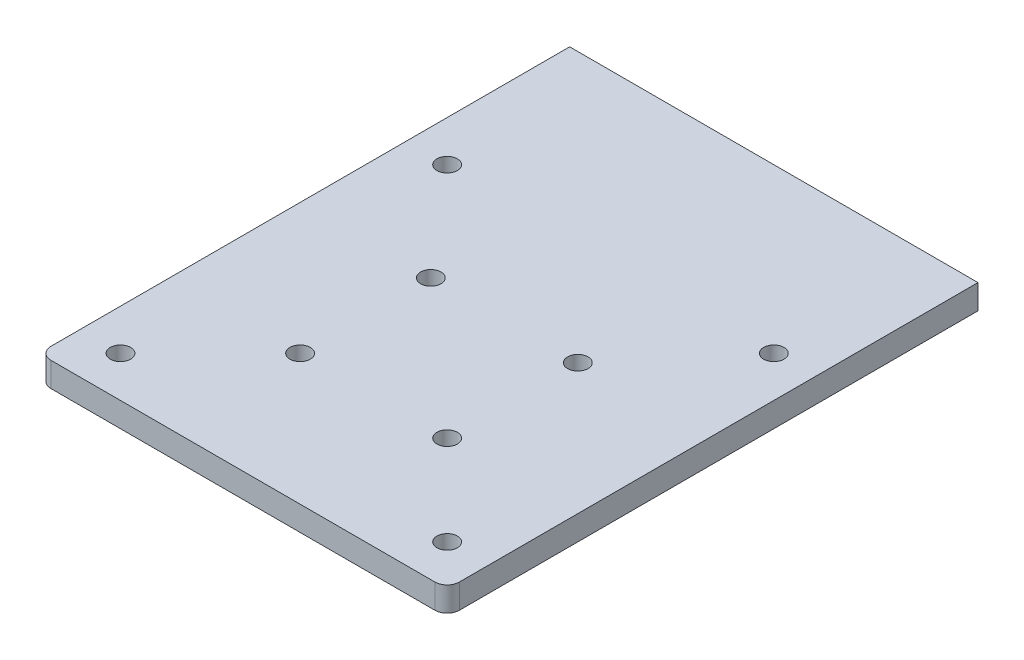
ISO-10303-21;
HEADER;
FILE_DESCRIPTION(('STEP AP214'),'2;1');
FILE_NAME('part.step','',(''),(''),'','','');
FILE_SCHEMA(('AUTOMOTIVE_DESIGN { 1 0 10303 214 1 1 1 1 }'));
ENDSEC;
DATA;
#1=APPLICATION_CONTEXT('core data for automotive mechanical design processes');
#2=APPLICATION_PROTOCOL_DEFINITION('international standard','automotive_design',2000,#1);
#3=PRODUCT_CONTEXT('',#1,'mechanical');
#4=PRODUCT('Part','Part','',(#3));
#5=PRODUCT_RELATED_PRODUCT_CATEGORY('part','',(#4));
#6=PRODUCT_DEFINITION_FORMATION('','',#4);
#7=PRODUCT_DEFINITION_CONTEXT('part definition',#1,'design');
#8=PRODUCT_DEFINITION('design','',#6,#7);
#9=PRODUCT_DEFINITION_SHAPE('','',#8);
#10=(LENGTH_UNIT() NAMED_UNIT(*) SI_UNIT(.MILLI.,.METRE.));
#11=(NAMED_UNIT(*) PLANE_ANGLE_UNIT() SI_UNIT($,.RADIAN.));
#12=(NAMED_UNIT(*) SI_UNIT($,.STERADIAN.) SOLID_ANGLE_UNIT());
#13=UNCERTAINTY_MEASURE_WITH_UNIT(LENGTH_MEASURE(1.E-05),#10,'distance_accuracy_value','');
#14=(GEOMETRIC_REPRESENTATION_CONTEXT(3) GLOBAL_UNCERTAINTY_ASSIGNED_CONTEXT((#13)) GLOBAL_UNIT_ASSIGNED_CONTEXT((#10,
#11,#12)) REPRESENTATION_CONTEXT('',''));
#15=CARTESIAN_POINT('',(0.,0.,0.));
#16=DIRECTION('',(0.,0.,1.));
#17=DIRECTION('',(1.,0.,0.));
#18=AXIS2_PLACEMENT_3D('',#15,#16,#17);
#19=CARTESIAN_POINT('',(-260.,25.5,358.898194803122));
#20=DIRECTION('',(0.,1.,0.));
#21=DIRECTION('',(0.,0.,1.));
#22=AXIS2_PLACEMENT_3D('',#19,#20,#21);
#23=PLANE('',#22);
#24=CARTESIAN_POINT('',(-95.0000000000001,25.5,-46.1018051968785));
#25=DIRECTION('',(0.,1.,0.));
#26=DIRECTION('',(0.,0.,1.));
#27=AXIS2_PLACEMENT_3D('',#24,#25,#26);
#28=CIRCLE('',#27,18.75);
#29=CARTESIAN_POINT('',(-95.0000000000001,25.5,-27.3518051968785));
#30=VERTEX_POINT('',#29);
#31=EDGE_CURVE('E214',#30,#30,#28,.T.);
#32=ORIENTED_EDGE('',*,*,#31,.F.);
#33=EDGE_LOOP('',(#32));
#34=FACE_BOUND('',#33,.T.);
#35=CARTESIAN_POINT('',(-95.0000000000001,25.5,193.898194803122));
#36=DIRECTION('',(0.,1.,0.));
#37=DIRECTION('',(0.,0.,1.));
#38=AXIS2_PLACEMENT_3D('',#35,#36,#37);
#39=CIRCLE('',#38,18.75);
#40=CARTESIAN_POINT('',(-95.0000000000001,25.5,212.648194803122));
#41=VERTEX_POINT('',#40);
#42=EDGE_CURVE('E198',#41,#41,#39,.T.);
#43=ORIENTED_EDGE('',*,*,#42,.F.);
#44=EDGE_LOOP('',(#43));
#45=FACE_BOUND('',#44,.T.);
#46=CARTESIAN_POINT('',(-260.,25.5,-241.101805196879));
#47=DIRECTION('',(0.,1.,0.));
#48=DIRECTION('',(0.,0.,1.));
#49=AXIS2_PLACEMENT_3D('',#46,#47,#48);
#50=CIRCLE('',#49,18.75);
#51=CARTESIAN_POINT('',(-260.,25.5,-222.351805196879));
#52=VERTEX_POINT('',#51);
#53=EDGE_CURVE('E182',#52,#52,#50,.T.);
#54=ORIENTED_EDGE('',*,*,#53,.F.);
#55=EDGE_LOOP('',(#54));
#56=FACE_BOUND('',#55,.T.);
#57=CARTESIAN_POINT('',(-260.,25.5,358.898194803122));
#58=DIRECTION('',(0.,1.,0.));
#59=DIRECTION('',(0.,0.,1.));
#60=AXIS2_PLACEMENT_3D('',#57,#58,#59);
#61=CIRCLE('',#60,18.75);
#62=CARTESIAN_POINT('',(-260.,25.5,377.648194803122));
#63=VERTEX_POINT('',#62);
#64=EDGE_CURVE('E126',#63,#63,#61,.T.);
#65=ORIENTED_EDGE('',*,*,#64,.F.);
#66=EDGE_LOOP('',(#65));
#67=FACE_BOUND('',#66,.T.);
#68=DIRECTION('',(0.,0.,1.));
#69=VECTOR('',#68,1.);
#70=CARTESIAN_POINT('',(-335.,25.5,-541.101805196879));
#71=LINE('',#70,#69);
#72=CARTESIAN_POINT('',(-335.,25.5,-541.101805196879));
#73=VERTEX_POINT('',#72);
#74=CARTESIAN_POINT('',(-335.,25.5,411.398194803121));
#75=VERTEX_POINT('',#74);
#76=EDGE_CURVE('E134',#73,#75,#71,.T.);
#77=ORIENTED_EDGE('',*,*,#76,.T.);
#78=CARTESIAN_POINT('',(-312.5,25.5,411.398194803122));
#79=DIRECTION('',(0.,1.,0.));
#80=DIRECTION('',(0.,0.,1.));
#81=AXIS2_PLACEMENT_3D('',#78,#79,#80);
#82=CIRCLE('',#81,22.5);
#83=CARTESIAN_POINT('',(-312.5,25.5,433.898194803122));
#84=VERTEX_POINT('',#83);
#85=EDGE_CURVE('E47',#75,#84,#82,.T.);
#86=ORIENTED_EDGE('',*,*,#85,.T.);
#87=DIRECTION('',(1.,0.,0.));
#88=VECTOR('',#87,1.);
#89=CARTESIAN_POINT('',(-335.,25.5,433.898194803122));
#90=LINE('',#89,#88);
#91=CARTESIAN_POINT('',(392.5,25.5,433.898194803122));
#92=VERTEX_POINT('',#91);
#93=EDGE_CURVE('E101',#84,#92,#90,.T.);
#94=ORIENTED_EDGE('',*,*,#93,.T.);
#95=CARTESIAN_POINT('',(392.5,25.5,411.398194803121));
#96=DIRECTION('',(0.,1.,0.));
#97=DIRECTION('',(0.,0.,1.));
#98=AXIS2_PLACEMENT_3D('',#95,#96,#97);
#99=CIRCLE('',#98,22.5);
#100=CARTESIAN_POINT('',(415.,25.5,411.398194803121));
#101=VERTEX_POINT('',#100);
#102=EDGE_CURVE('E54',#92,#101,#99,.T.);
#103=ORIENTED_EDGE('',*,*,#102,.T.);
#104=DIRECTION('',(0.,0.,-1.));
#105=VECTOR('',#104,1.);
#106=CARTESIAN_POINT('',(415.,25.5,-541.101805196879));
#107=LINE('',#106,#105);
#108=CARTESIAN_POINT('',(415.,25.5,-541.101805196879));
#109=VERTEX_POINT('',#108);
#110=EDGE_CURVE('E92',#101,#109,#107,.T.);
#111=ORIENTED_EDGE('',*,*,#110,.T.);
#112=DIRECTION('',(-1.,0.,0.));
#113=VECTOR('',#112,1.);
#114=CARTESIAN_POINT('',(-335.,25.5,-541.101805196879));
#115=LINE('',#114,#113);
#116=EDGE_CURVE('E96',#109,#73,#115,.T.);
#117=ORIENTED_EDGE('',*,*,#116,.T.);
#118=EDGE_LOOP('',(#77,#86,#94,#103,#111,#117));
#119=FACE_BOUND('',#118,.T.);
#120=CARTESIAN_POINT('',(340.,25.5,358.898194803122));
#121=DIRECTION('',(0.,1.,0.));
#122=DIRECTION('',(0.,0.,1.));
#123=AXIS2_PLACEMENT_3D('',#120,#121,#122);
#124=CIRCLE('',#123,18.75);
#125=CARTESIAN_POINT('',(340.,25.5,377.648194803122));
#126=VERTEX_POINT('',#125);
#127=EDGE_CURVE('E174',#126,#126,#124,.T.);
#128=ORIENTED_EDGE('',*,*,#127,.F.);
#129=EDGE_LOOP('',(#128));
#130=FACE_BOUND('',#129,.T.);
#131=CARTESIAN_POINT('',(340.,25.5,-241.101805196879));
#132=DIRECTION('',(0.,1.,0.));
#133=DIRECTION('',(0.,0.,1.));
#134=AXIS2_PLACEMENT_3D('',#131,#132,#133);
#135=CIRCLE('',#134,18.75);
#136=CARTESIAN_POINT('',(340.,25.5,-222.351805196879));
#137=VERTEX_POINT('',#136);
#138=EDGE_CURVE('E190',#137,#137,#135,.T.);
#139=ORIENTED_EDGE('',*,*,#138,.F.);
#140=EDGE_LOOP('',(#139));
#141=FACE_BOUND('',#140,.T.);
#142=CARTESIAN_POINT('',(175.,25.5,193.898194803122));
#143=DIRECTION('',(0.,1.,0.));
#144=DIRECTION('',(0.,0.,1.));
#145=AXIS2_PLACEMENT_3D('',#142,#143,#144);
#146=CIRCLE('',#145,18.75);
#147=CARTESIAN_POINT('',(175.,25.5,212.648194803122));
#148=VERTEX_POINT('',#147);
#149=EDGE_CURVE('E206',#148,#148,#146,.T.);
#150=ORIENTED_EDGE('',*,*,#149,.F.);
#151=EDGE_LOOP('',(#150));
#152=FACE_BOUND('',#151,.T.);
#153=CARTESIAN_POINT('',(175.,25.5,-46.1018051968785));
#154=DIRECTION('',(0.,1.,0.));
#155=DIRECTION('',(0.,0.,1.));
#156=AXIS2_PLACEMENT_3D('',#153,#154,#155);
#157=CIRCLE('',#156,18.7500000000001);
#158=CARTESIAN_POINT('',(175.,25.5,-27.3518051968784));
#159=VERTEX_POINT('',#158);
#160=EDGE_CURVE('E222',#159,#159,#157,.T.);
#161=ORIENTED_EDGE('',*,*,#160,.F.);
#162=EDGE_LOOP('',(#161));
#163=FACE_BOUND('',#162,.T.);
#164=ADVANCED_FACE('F38',(#34,#45,#56,#67,#119,#130,#141,#152,#163),#23,.T.);
#165=CARTESIAN_POINT('',(-260.,-19.5,358.898194803122));
#166=DIRECTION('',(0.,1.,0.));
#167=DIRECTION('',(0.,0.,1.));
#168=AXIS2_PLACEMENT_3D('',#165,#166,#167);
#169=PLANE('',#168);
#170=CARTESIAN_POINT('',(-95.0000000000001,-19.5,-46.1018051968785));
#171=DIRECTION('',(0.,1.,0.));
#172=DIRECTION('',(0.,0.,1.));
#173=AXIS2_PLACEMENT_3D('',#170,#171,#172);
#174=CIRCLE('',#173,18.75);
#175=CARTESIAN_POINT('',(-95.0000000000001,-19.5,-27.3518051968785));
#176=VERTEX_POINT('',#175);
#177=EDGE_CURVE('E218',#176,#176,#174,.T.);
#178=ORIENTED_EDGE('',*,*,#177,.T.);
#179=EDGE_LOOP('',(#178));
#180=FACE_BOUND('',#179,.T.);
#181=CARTESIAN_POINT('',(-95.0000000000001,-19.5,193.898194803122));
#182=DIRECTION('',(0.,1.,0.));
#183=DIRECTION('',(0.,0.,1.));
#184=AXIS2_PLACEMENT_3D('',#181,#182,#183);
#185=CIRCLE('',#184,18.75);
#186=CARTESIAN_POINT('',(-95.0000000000001,-19.5,212.648194803122));
#187=VERTEX_POINT('',#186);
#188=EDGE_CURVE('E202',#187,#187,#185,.T.);
#189=ORIENTED_EDGE('',*,*,#188,.T.);
#190=EDGE_LOOP('',(#189));
#191=FACE_BOUND('',#190,.T.);
#192=CARTESIAN_POINT('',(-260.,-19.5,-241.101805196879));
#193=DIRECTION('',(0.,1.,0.));
#194=DIRECTION('',(0.,0.,1.));
#195=AXIS2_PLACEMENT_3D('',#192,#193,#194);
#196=CIRCLE('',#195,18.75);
#197=CARTESIAN_POINT('',(-260.,-19.5,-222.351805196879));
#198=VERTEX_POINT('',#197);
#199=EDGE_CURVE('E186',#198,#198,#196,.T.);
#200=ORIENTED_EDGE('',*,*,#199,.T.);
#201=EDGE_LOOP('',(#200));
#202=FACE_BOUND('',#201,.T.);
#203=CARTESIAN_POINT('',(-260.,-19.5,358.898194803122));
#204=DIRECTION('',(0.,1.,0.));
#205=DIRECTION('',(0.,0.,1.));
#206=AXIS2_PLACEMENT_3D('',#203,#204,#205);
#207=CIRCLE('',#206,18.75);
#208=CARTESIAN_POINT('',(-260.,-19.5,377.648194803122));
#209=VERTEX_POINT('',#208);
#210=EDGE_CURVE('E170',#209,#209,#207,.T.);
#211=ORIENTED_EDGE('',*,*,#210,.T.);
#212=EDGE_LOOP('',(#211));
#213=FACE_BOUND('',#212,.T.);
#214=DIRECTION('',(1.,0.,0.));
#215=VECTOR('',#214,1.);
#216=CARTESIAN_POINT('',(-335.,-19.5,433.898194803122));
#217=LINE('',#216,#215);
#218=CARTESIAN_POINT('',(-312.5,-19.5,433.898194803122));
#219=VERTEX_POINT('',#218);
#220=CARTESIAN_POINT('',(392.5,-19.5,433.898194803122));
#221=VERTEX_POINT('',#220);
#222=EDGE_CURVE('E125',#219,#221,#217,.T.);
#223=ORIENTED_EDGE('',*,*,#222,.F.);
#224=CARTESIAN_POINT('',(-312.5,-19.5,411.398194803122));
#225=DIRECTION('',(0.,1.,0.));
#226=DIRECTION('',(0.,0.,1.));
#227=AXIS2_PLACEMENT_3D('',#224,#225,#226);
#228=CIRCLE('',#227,22.5);
#229=CARTESIAN_POINT('',(-335.,-19.5,411.398194803121));
#230=VERTEX_POINT('',#229);
#231=EDGE_CURVE('E145',#219,#230,#228,.F.);
#232=ORIENTED_EDGE('',*,*,#231,.T.);
#233=DIRECTION('',(0.,0.,1.));
#234=VECTOR('',#233,1.);
#235=CARTESIAN_POINT('',(-335.,-19.5,-541.101805196879));
#236=LINE('',#235,#234);
#237=CARTESIAN_POINT('',(-335.,-19.5,-541.101805196879));
#238=VERTEX_POINT('',#237);
#239=EDGE_CURVE('E122',#238,#230,#236,.T.);
#240=ORIENTED_EDGE('',*,*,#239,.F.);
#241=DIRECTION('',(-1.,0.,0.));
#242=VECTOR('',#241,1.);
#243=CARTESIAN_POINT('',(-335.,-19.5,-541.101805196879));
#244=LINE('',#243,#242);
#245=CARTESIAN_POINT('',(415.,-19.5,-541.101805196879));
#246=VERTEX_POINT('',#245);
#247=EDGE_CURVE('E132',#246,#238,#244,.T.);
#248=ORIENTED_EDGE('',*,*,#247,.F.);
#249=DIRECTION('',(0.,0.,-1.));
#250=VECTOR('',#249,1.);
#251=CARTESIAN_POINT('',(415.,-19.5,-541.101805196879));
#252=LINE('',#251,#250);
#253=CARTESIAN_POINT('',(415.,-19.5,411.398194803121));
#254=VERTEX_POINT('',#253);
#255=EDGE_CURVE('E107',#254,#246,#252,.T.);
#256=ORIENTED_EDGE('',*,*,#255,.F.);
#257=CARTESIAN_POINT('',(392.5,-19.5,411.398194803121));
#258=DIRECTION('',(0.,1.,0.));
#259=DIRECTION('',(0.,0.,1.));
#260=AXIS2_PLACEMENT_3D('',#257,#258,#259);
#261=CIRCLE('',#260,22.5);
#262=EDGE_CURVE('E142',#254,#221,#261,.F.);
#263=ORIENTED_EDGE('',*,*,#262,.T.);
#264=EDGE_LOOP('',(#223,#232,#240,#248,#256,#263));
#265=FACE_BOUND('',#264,.T.);
#266=CARTESIAN_POINT('',(340.,-19.5,358.898194803122));
#267=DIRECTION('',(0.,1.,0.));
#268=DIRECTION('',(0.,0.,1.));
#269=AXIS2_PLACEMENT_3D('',#266,#267,#268);
#270=CIRCLE('',#269,18.75);
#271=CARTESIAN_POINT('',(340.,-19.5,377.648194803122));
#272=VERTEX_POINT('',#271);
#273=EDGE_CURVE('E178',#272,#272,#270,.T.);
#274=ORIENTED_EDGE('',*,*,#273,.T.);
#275=EDGE_LOOP('',(#274));
#276=FACE_BOUND('',#275,.T.);
#277=CARTESIAN_POINT('',(340.,-19.5,-241.101805196879));
#278=DIRECTION('',(0.,1.,0.));
#279=DIRECTION('',(0.,0.,1.));
#280=AXIS2_PLACEMENT_3D('',#277,#278,#279);
#281=CIRCLE('',#280,18.75);
#282=CARTESIAN_POINT('',(340.,-19.5,-222.351805196879));
#283=VERTEX_POINT('',#282);
#284=EDGE_CURVE('E194',#283,#283,#281,.T.);
#285=ORIENTED_EDGE('',*,*,#284,.T.);
#286=EDGE_LOOP('',(#285));
#287=FACE_BOUND('',#286,.T.);
#288=CARTESIAN_POINT('',(175.,-19.5,193.898194803122));
#289=DIRECTION('',(0.,1.,0.));
#290=DIRECTION('',(0.,0.,1.));
#291=AXIS2_PLACEMENT_3D('',#288,#289,#290);
#292=CIRCLE('',#291,18.75);
#293=CARTESIAN_POINT('',(175.,-19.5,212.648194803122));
#294=VERTEX_POINT('',#293);
#295=EDGE_CURVE('E210',#294,#294,#292,.T.);
#296=ORIENTED_EDGE('',*,*,#295,.T.);
#297=EDGE_LOOP('',(#296));
#298=FACE_BOUND('',#297,.T.);
#299=CARTESIAN_POINT('',(175.,-19.5,-46.1018051968785));
#300=DIRECTION('',(0.,1.,0.));
#301=DIRECTION('',(0.,0.,1.));
#302=AXIS2_PLACEMENT_3D('',#299,#300,#301);
#303=CIRCLE('',#302,18.7500000000001);
#304=CARTESIAN_POINT('',(175.,-19.5,-27.3518051968784));
#305=VERTEX_POINT('',#304);
#306=EDGE_CURVE('E226',#305,#305,#303,.T.);
#307=ORIENTED_EDGE('',*,*,#306,.T.);
#308=EDGE_LOOP('',(#307));
#309=FACE_BOUND('',#308,.T.);
#310=ADVANCED_FACE('F164',(#180,#191,#202,#213,#265,#276,#287,#298,#309),#169,.F.);
#311=CARTESIAN_POINT('',(-335.,25.5,-541.101805196879));
#312=DIRECTION('',(1.,0.,0.));
#313=DIRECTION('',(0.,0.,-1.));
#314=AXIS2_PLACEMENT_3D('',#311,#312,#313);
#315=PLANE('',#314);
#316=ORIENTED_EDGE('',*,*,#239,.T.);
#317=DIRECTION('',(0.,-1.,0.));
#318=VECTOR('',#317,1.);
#319=CARTESIAN_POINT('',(-335.,25.5,411.398194803121));
#320=LINE('',#319,#318);
#321=EDGE_CURVE('E62',#230,#75,#320,.F.);
#322=ORIENTED_EDGE('',*,*,#321,.T.);
#323=ORIENTED_EDGE('',*,*,#76,.F.);
#324=DIRECTION('',(0.,-1.,0.));
#325=VECTOR('',#324,1.);
#326=CARTESIAN_POINT('',(-335.,25.5,-541.101805196879));
#327=LINE('',#326,#325);
#328=EDGE_CURVE('E112',#73,#238,#327,.T.);
#329=ORIENTED_EDGE('',*,*,#328,.T.);
#330=EDGE_LOOP('',(#316,#322,#323,#329));
#331=FACE_BOUND('',#330,.T.);
#332=ADVANCED_FACE('F166',(#331),#315,.F.);
#333=CARTESIAN_POINT('',(-335.,25.5,433.898194803122));
#334=DIRECTION('',(0.,0.,-1.));
#335=DIRECTION('',(-1.,0.,0.));
#336=AXIS2_PLACEMENT_3D('',#333,#334,#335);
#337=PLANE('',#336);
#338=ORIENTED_EDGE('',*,*,#93,.F.);
#339=DIRECTION('',(0.,-1.,0.));
#340=VECTOR('',#339,1.);
#341=CARTESIAN_POINT('',(-312.5,25.5,433.898194803122));
#342=LINE('',#341,#340);
#343=EDGE_CURVE('E138',#84,#219,#342,.T.);
#344=ORIENTED_EDGE('',*,*,#343,.T.);
#345=ORIENTED_EDGE('',*,*,#222,.T.);
#346=DIRECTION('',(0.,-1.,0.));
#347=VECTOR('',#346,1.);
#348=CARTESIAN_POINT('',(392.5,25.5,433.898194803122));
#349=LINE('',#348,#347);
#350=EDGE_CURVE('E111',#221,#92,#349,.F.);
#351=ORIENTED_EDGE('',*,*,#350,.T.);
#352=EDGE_LOOP('',(#338,#344,#345,#351));
#353=FACE_BOUND('',#352,.T.);
#354=ADVANCED_FACE('F157',(#353),#337,.F.);
#355=CARTESIAN_POINT('',(415.,25.5,-541.101805196879));
#356=DIRECTION('',(-1.,0.,0.));
#357=DIRECTION('',(0.,0.,1.));
#358=AXIS2_PLACEMENT_3D('',#355,#356,#357);
#359=PLANE('',#358);
#360=ORIENTED_EDGE('',*,*,#110,.F.);
#361=DIRECTION('',(0.,-1.,0.));
#362=VECTOR('',#361,1.);
#363=CARTESIAN_POINT('',(415.,25.5,411.398194803121));
#364=LINE('',#363,#362);
#365=EDGE_CURVE('E11',#101,#254,#364,.T.);
#366=ORIENTED_EDGE('',*,*,#365,.T.);
#367=ORIENTED_EDGE('',*,*,#255,.T.);
#368=DIRECTION('',(0.,-1.,0.));
#369=VECTOR('',#368,1.);
#370=CARTESIAN_POINT('',(415.,25.5,-541.101805196879));
#371=LINE('',#370,#369);
#372=EDGE_CURVE('E104',#109,#246,#371,.T.);
#373=ORIENTED_EDGE('',*,*,#372,.F.);
#374=EDGE_LOOP('',(#360,#366,#367,#373));
#375=FACE_BOUND('',#374,.T.);
#376=ADVANCED_FACE('F105',(#375),#359,.F.);
#377=CARTESIAN_POINT('',(-335.,25.5,-541.101805196879));
#378=DIRECTION('',(0.,0.,1.));
#379=DIRECTION('',(1.,0.,0.));
#380=AXIS2_PLACEMENT_3D('',#377,#378,#379);
#381=PLANE('',#380);
#382=ORIENTED_EDGE('',*,*,#247,.T.);
#383=ORIENTED_EDGE('',*,*,#328,.F.);
#384=ORIENTED_EDGE('',*,*,#116,.F.);
#385=ORIENTED_EDGE('',*,*,#372,.T.);
#386=EDGE_LOOP('',(#382,#383,#384,#385));
#387=FACE_BOUND('',#386,.T.);
#388=ADVANCED_FACE('F114',(#387),#381,.F.);
#389=CARTESIAN_POINT('',(-260.,25.5,358.898194803122));
#390=DIRECTION('',(0.,-1.,0.));
#391=DIRECTION('',(0.,0.,-1.));
#392=AXIS2_PLACEMENT_3D('',#389,#390,#391);
#393=CYLINDRICAL_SURFACE('',#392,18.75);
#394=ORIENTED_EDGE('',*,*,#64,.T.);
#395=EDGE_LOOP('',(#394));
#396=FACE_BOUND('',#395,.T.);
#397=ORIENTED_EDGE('',*,*,#210,.F.);
#398=EDGE_LOOP('',(#397));
#399=FACE_BOUND('',#398,.T.);
#400=ADVANCED_FACE('F248',(#396,#399),#393,.F.);
#401=CARTESIAN_POINT('',(340.,25.5,358.898194803122));
#402=DIRECTION('',(0.,-1.,0.));
#403=DIRECTION('',(0.,0.,-1.));
#404=AXIS2_PLACEMENT_3D('',#401,#402,#403);
#405=CYLINDRICAL_SURFACE('',#404,18.75);
#406=ORIENTED_EDGE('',*,*,#127,.T.);
#407=EDGE_LOOP('',(#406));
#408=FACE_BOUND('',#407,.T.);
#409=ORIENTED_EDGE('',*,*,#273,.F.);
#410=EDGE_LOOP('',(#409));
#411=FACE_BOUND('',#410,.T.);
#412=ADVANCED_FACE('F286',(#408,#411),#405,.F.);
#413=CARTESIAN_POINT('',(-260.,25.5,-241.101805196879));
#414=DIRECTION('',(0.,-1.,0.));
#415=DIRECTION('',(0.,0.,-1.));
#416=AXIS2_PLACEMENT_3D('',#413,#414,#415);
#417=CYLINDRICAL_SURFACE('',#416,18.75);
#418=ORIENTED_EDGE('',*,*,#53,.T.);
#419=EDGE_LOOP('',(#418));
#420=FACE_BOUND('',#419,.T.);
#421=ORIENTED_EDGE('',*,*,#199,.F.);
#422=EDGE_LOOP('',(#421));
#423=FACE_BOUND('',#422,.T.);
#424=ADVANCED_FACE('F283',(#420,#423),#417,.F.);
#425=CARTESIAN_POINT('',(340.,25.5,-241.101805196879));
#426=DIRECTION('',(0.,-1.,0.));
#427=DIRECTION('',(0.,0.,-1.));
#428=AXIS2_PLACEMENT_3D('',#425,#426,#427);
#429=CYLINDRICAL_SURFACE('',#428,18.75);
#430=ORIENTED_EDGE('',*,*,#138,.T.);
#431=EDGE_LOOP('',(#430));
#432=FACE_BOUND('',#431,.T.);
#433=ORIENTED_EDGE('',*,*,#284,.F.);
#434=EDGE_LOOP('',(#433));
#435=FACE_BOUND('',#434,.T.);
#436=ADVANCED_FACE('F279',(#432,#435),#429,.F.);
#437=CARTESIAN_POINT('',(-95.0000000000001,25.5,193.898194803122));
#438=DIRECTION('',(0.,-1.,0.));
#439=DIRECTION('',(0.,0.,-1.));
#440=AXIS2_PLACEMENT_3D('',#437,#438,#439);
#441=CYLINDRICAL_SURFACE('',#440,18.75);
#442=ORIENTED_EDGE('',*,*,#42,.T.);
#443=EDGE_LOOP('',(#442));
#444=FACE_BOUND('',#443,.T.);
#445=ORIENTED_EDGE('',*,*,#188,.F.);
#446=EDGE_LOOP('',(#445));
#447=FACE_BOUND('',#446,.T.);
#448=ADVANCED_FACE('F275',(#444,#447),#441,.F.);
#449=CARTESIAN_POINT('',(175.,25.5,193.898194803122));
#450=DIRECTION('',(0.,-1.,0.));
#451=DIRECTION('',(0.,0.,-1.));
#452=AXIS2_PLACEMENT_3D('',#449,#450,#451);
#453=CYLINDRICAL_SURFACE('',#452,18.75);
#454=ORIENTED_EDGE('',*,*,#149,.T.);
#455=EDGE_LOOP('',(#454));
#456=FACE_BOUND('',#455,.T.);
#457=ORIENTED_EDGE('',*,*,#295,.F.);
#458=EDGE_LOOP('',(#457));
#459=FACE_BOUND('',#458,.T.);
#460=ADVANCED_FACE('F269',(#456,#459),#453,.F.);
#461=CARTESIAN_POINT('',(-95.0000000000001,25.5,-46.1018051968785));
#462=DIRECTION('',(0.,-1.,0.));
#463=DIRECTION('',(0.,0.,-1.));
#464=AXIS2_PLACEMENT_3D('',#461,#462,#463);
#465=CYLINDRICAL_SURFACE('',#464,18.75);
#466=ORIENTED_EDGE('',*,*,#31,.T.);
#467=EDGE_LOOP('',(#466));
#468=FACE_BOUND('',#467,.T.);
#469=ORIENTED_EDGE('',*,*,#177,.F.);
#470=EDGE_LOOP('',(#469));
#471=FACE_BOUND('',#470,.T.);
#472=ADVANCED_FACE('F264',(#468,#471),#465,.F.);
#473=CARTESIAN_POINT('',(175.,25.5,-46.1018051968785));
#474=DIRECTION('',(0.,-1.,0.));
#475=DIRECTION('',(0.,0.,-1.));
#476=AXIS2_PLACEMENT_3D('',#473,#474,#475);
#477=CYLINDRICAL_SURFACE('',#476,18.7500000000001);
#478=ORIENTED_EDGE('',*,*,#160,.T.);
#479=EDGE_LOOP('',(#478));
#480=FACE_BOUND('',#479,.T.);
#481=ORIENTED_EDGE('',*,*,#306,.F.);
#482=EDGE_LOOP('',(#481));
#483=FACE_BOUND('',#482,.T.);
#484=ADVANCED_FACE('F234',(#480,#483),#477,.F.);
#485=CARTESIAN_POINT('',(-312.5,25.5,411.398194803122));
#486=DIRECTION('',(0.,-1.,0.));
#487=DIRECTION('',(0.,0.,-1.));
#488=AXIS2_PLACEMENT_3D('',#485,#486,#487);
#489=CYLINDRICAL_SURFACE('',#488,22.5);
#490=ORIENTED_EDGE('',*,*,#85,.F.);
#491=ORIENTED_EDGE('',*,*,#321,.F.);
#492=ORIENTED_EDGE('',*,*,#231,.F.);
#493=ORIENTED_EDGE('',*,*,#343,.F.);
#494=EDGE_LOOP('',(#490,#491,#492,#493));
#495=FACE_BOUND('',#494,.T.);
#496=ADVANCED_FACE('F161',(#495),#489,.T.);
#497=CARTESIAN_POINT('',(392.5,25.5,411.398194803121));
#498=DIRECTION('',(0.,-1.,0.));
#499=DIRECTION('',(0.,0.,-1.));
#500=AXIS2_PLACEMENT_3D('',#497,#498,#499);
#501=CYLINDRICAL_SURFACE('',#500,22.5);
#502=ORIENTED_EDGE('',*,*,#102,.F.);
#503=ORIENTED_EDGE('',*,*,#350,.F.);
#504=ORIENTED_EDGE('',*,*,#262,.F.);
#505=ORIENTED_EDGE('',*,*,#365,.F.);
#506=EDGE_LOOP('',(#502,#503,#504,#505));
#507=FACE_BOUND('',#506,.T.);
#508=ADVANCED_FACE('F40',(#507),#501,.T.);
#509=CLOSED_SHELL('',(#164,#310,#332,#354,#376,#388,#400,#412,#424,#436,#448,#460,#472,#484,
#496,#508));
#510=MANIFOLD_SOLID_BREP('B2',#509);
#511=ADVANCED_BREP_SHAPE_REPRESENTATION('',(#18,#510),#14);
#512=SHAPE_DEFINITION_REPRESENTATION(#9,#511);
ENDSEC;
END-ISO-10303-21;
